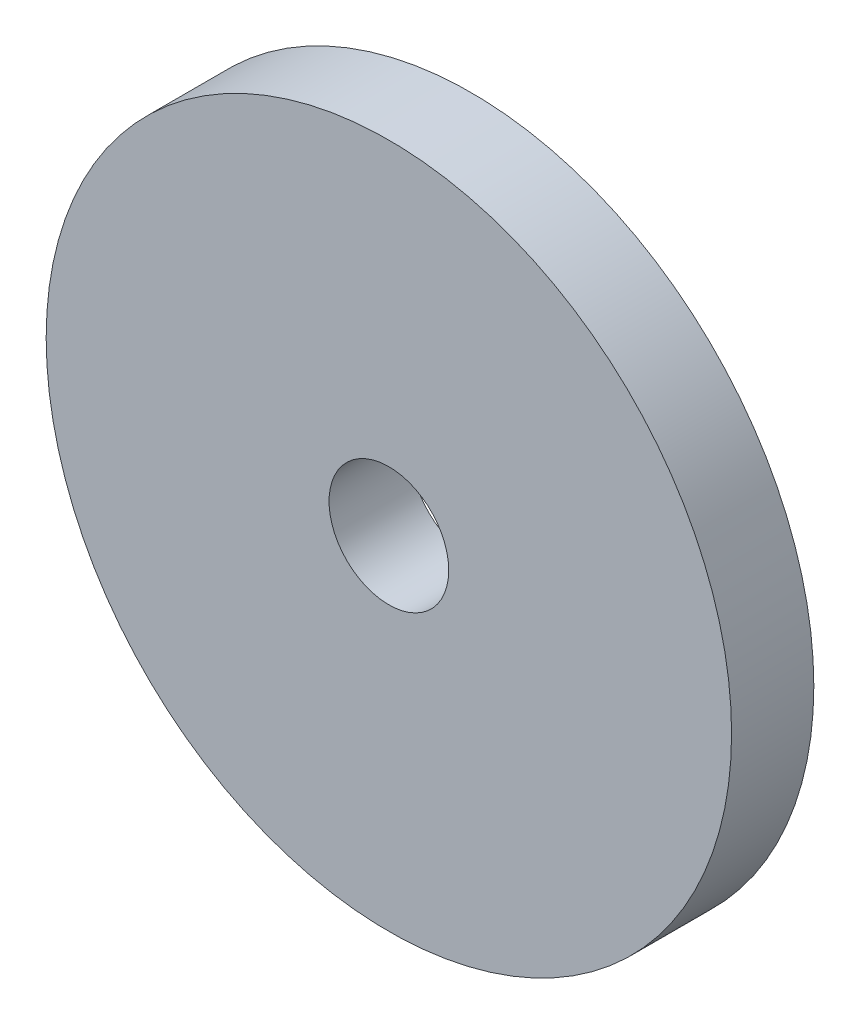
ISO-10303-21;
HEADER;
FILE_DESCRIPTION(('STEP AP214'),'2;1');
FILE_NAME('part.step','',(''),(''),'','','');
FILE_SCHEMA(('AUTOMOTIVE_DESIGN { 1 0 10303 214 1 1 1 1 }'));
ENDSEC;
DATA;
#1=APPLICATION_CONTEXT('core data for automotive mechanical design processes');
#2=APPLICATION_PROTOCOL_DEFINITION('international standard','automotive_design',2000,#1);
#3=PRODUCT_CONTEXT('',#1,'mechanical');
#4=PRODUCT('Part','Part','',(#3));
#5=PRODUCT_RELATED_PRODUCT_CATEGORY('part','',(#4));
#6=PRODUCT_DEFINITION_FORMATION('','',#4);
#7=PRODUCT_DEFINITION_CONTEXT('part definition',#1,'design');
#8=PRODUCT_DEFINITION('design','',#6,#7);
#9=PRODUCT_DEFINITION_SHAPE('','',#8);
#10=(LENGTH_UNIT() NAMED_UNIT(*) SI_UNIT(.MILLI.,.METRE.));
#11=(NAMED_UNIT(*) PLANE_ANGLE_UNIT() SI_UNIT($,.RADIAN.));
#12=(NAMED_UNIT(*) SI_UNIT($,.STERADIAN.) SOLID_ANGLE_UNIT());
#13=UNCERTAINTY_MEASURE_WITH_UNIT(LENGTH_MEASURE(1.E-05),#10,'distance_accuracy_value','');
#14=(GEOMETRIC_REPRESENTATION_CONTEXT(3) GLOBAL_UNCERTAINTY_ASSIGNED_CONTEXT((#13)) GLOBAL_UNIT_ASSIGNED_CONTEXT((#10,
#11,#12)) REPRESENTATION_CONTEXT('',''));
#15=CARTESIAN_POINT('',(0.,0.,0.));
#16=DIRECTION('',(0.,0.,1.));
#17=DIRECTION('',(1.,0.,0.));
#18=AXIS2_PLACEMENT_3D('',#15,#16,#17);
#19=CARTESIAN_POINT('',(0.,0.,7.62));
#20=DIRECTION('',(0.,0.,1.));
#21=DIRECTION('',(1.,0.,0.));
#22=AXIS2_PLACEMENT_3D('',#19,#20,#21);
#23=PLANE('',#22);
#24=CARTESIAN_POINT('',(0.,0.,7.62));
#25=DIRECTION('',(0.,0.,1.));
#26=DIRECTION('',(1.,0.,0.));
#27=AXIS2_PLACEMENT_3D('',#24,#25,#26);
#28=CIRCLE('',#27,31.75);
#29=CARTESIAN_POINT('',(31.75,0.,7.62));
#30=VERTEX_POINT('',#29);
#31=EDGE_CURVE('E10',#30,#30,#28,.T.);
#32=ORIENTED_EDGE('',*,*,#31,.T.);
#33=EDGE_LOOP('',(#32));
#34=FACE_BOUND('',#33,.T.);
#35=CARTESIAN_POINT('',(0.,0.,7.62));
#36=DIRECTION('',(0.,0.,1.));
#37=DIRECTION('',(1.,0.,0.));
#38=AXIS2_PLACEMENT_3D('',#35,#36,#37);
#39=CIRCLE('',#38,5.54325540454343);
#40=CARTESIAN_POINT('',(5.54325540454343,0.,7.62));
#41=VERTEX_POINT('',#40);
#42=EDGE_CURVE('E50',#41,#41,#39,.T.);
#43=ORIENTED_EDGE('',*,*,#42,.F.);
#44=EDGE_LOOP('',(#43));
#45=FACE_BOUND('',#44,.T.);
#46=ADVANCED_FACE('F37',(#34,#45),#23,.T.);
#47=CARTESIAN_POINT('',(0.,0.,0.));
#48=DIRECTION('',(0.,0.,1.));
#49=DIRECTION('',(1.,0.,0.));
#50=AXIS2_PLACEMENT_3D('',#47,#48,#49);
#51=PLANE('',#50);
#52=CARTESIAN_POINT('',(0.,0.,0.));
#53=DIRECTION('',(0.,0.,1.));
#54=DIRECTION('',(1.,0.,0.));
#55=AXIS2_PLACEMENT_3D('',#52,#53,#54);
#56=CIRCLE('',#55,31.75);
#57=CARTESIAN_POINT('',(31.75,0.,0.));
#58=VERTEX_POINT('',#57);
#59=EDGE_CURVE('E41',#58,#58,#56,.T.);
#60=ORIENTED_EDGE('',*,*,#59,.F.);
#61=EDGE_LOOP('',(#60));
#62=FACE_BOUND('',#61,.T.);
#63=CARTESIAN_POINT('',(0.,0.,0.));
#64=DIRECTION('',(0.,0.,1.));
#65=DIRECTION('',(1.,0.,0.));
#66=AXIS2_PLACEMENT_3D('',#63,#64,#65);
#67=CIRCLE('',#66,5.54325540454343);
#68=CARTESIAN_POINT('',(5.54325540454343,0.,0.));
#69=VERTEX_POINT('',#68);
#70=EDGE_CURVE('E52',#69,#69,#67,.T.);
#71=ORIENTED_EDGE('',*,*,#70,.T.);
#72=EDGE_LOOP('',(#71));
#73=FACE_BOUND('',#72,.T.);
#74=ADVANCED_FACE('F64',(#62,#73),#51,.F.);
#75=CARTESIAN_POINT('',(0.,0.,7.62));
#76=DIRECTION('',(0.,0.,-1.));
#77=DIRECTION('',(-1.,0.,0.));
#78=AXIS2_PLACEMENT_3D('',#75,#76,#77);
#79=CYLINDRICAL_SURFACE('',#78,31.75);
#80=ORIENTED_EDGE('',*,*,#31,.F.);
#81=EDGE_LOOP('',(#80));
#82=FACE_BOUND('',#81,.T.);
#83=ORIENTED_EDGE('',*,*,#59,.T.);
#84=EDGE_LOOP('',(#83));
#85=FACE_BOUND('',#84,.T.);
#86=ADVANCED_FACE('F39',(#82,#85),#79,.T.);
#87=CARTESIAN_POINT('',(0.,0.,7.62));
#88=DIRECTION('',(0.,0.,-1.));
#89=DIRECTION('',(-1.,0.,0.));
#90=AXIS2_PLACEMENT_3D('',#87,#88,#89);
#91=CYLINDRICAL_SURFACE('',#90,5.54325540454343);
#92=ORIENTED_EDGE('',*,*,#42,.T.);
#93=EDGE_LOOP('',(#92));
#94=FACE_BOUND('',#93,.T.);
#95=ORIENTED_EDGE('',*,*,#70,.F.);
#96=EDGE_LOOP('',(#95));
#97=FACE_BOUND('',#96,.T.);
#98=ADVANCED_FACE('F60',(#94,#97),#91,.F.);
#99=CLOSED_SHELL('',(#46,#74,#86,#98));
#100=MANIFOLD_SOLID_BREP('B2',#99);
#101=ADVANCED_BREP_SHAPE_REPRESENTATION('',(#18,#100),#14);
#102=SHAPE_DEFINITION_REPRESENTATION(#9,#101);
ENDSEC;
END-ISO-10303-21;
